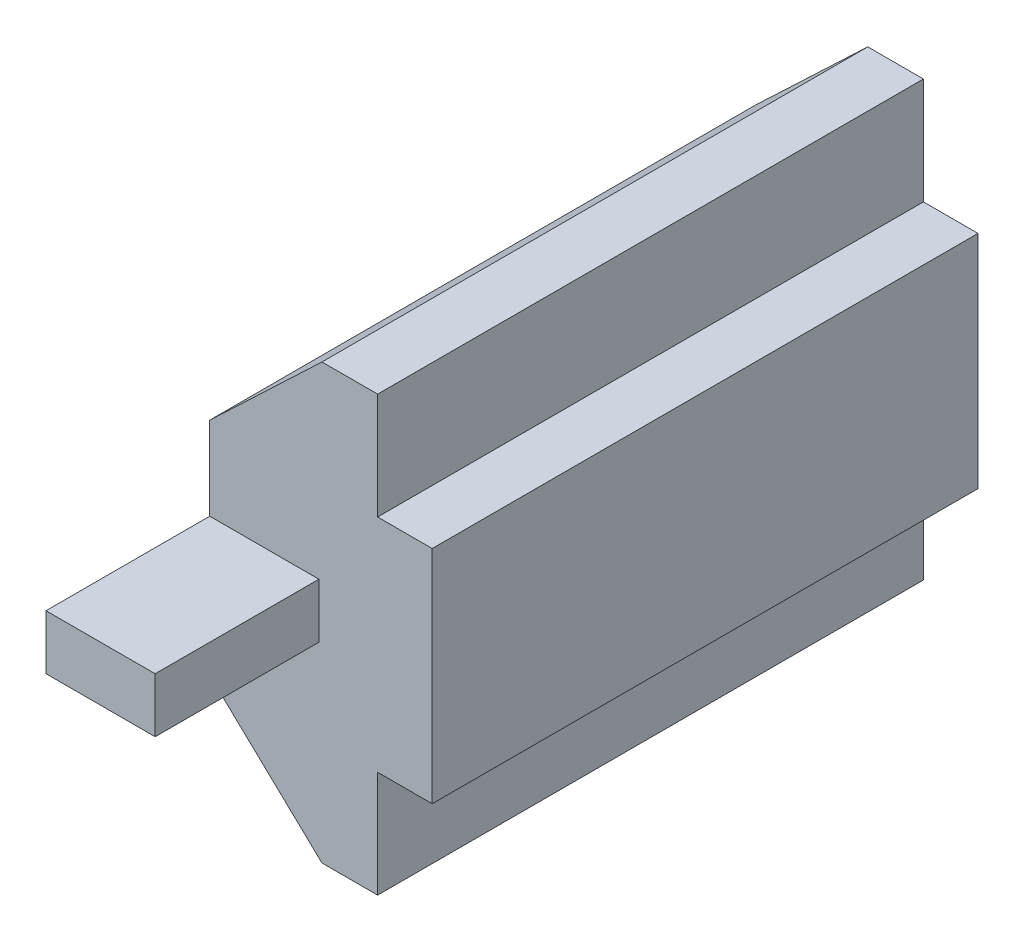
ISO-10303-21;
HEADER;
FILE_DESCRIPTION(('STEP AP214'),'2;1');
FILE_NAME('part.step','',(''),(''),'','','');
FILE_SCHEMA(('AUTOMOTIVE_DESIGN { 1 0 10303 214 1 1 1 1 }'));
ENDSEC;
DATA;
#1=APPLICATION_CONTEXT('core data for automotive mechanical design processes');
#2=APPLICATION_PROTOCOL_DEFINITION('international standard','automotive_design',2000,#1);
#3=PRODUCT_CONTEXT('',#1,'mechanical');
#4=PRODUCT('Part','Part','',(#3));
#5=PRODUCT_RELATED_PRODUCT_CATEGORY('part','',(#4));
#6=PRODUCT_DEFINITION_FORMATION('','',#4);
#7=PRODUCT_DEFINITION_CONTEXT('part definition',#1,'design');
#8=PRODUCT_DEFINITION('design','',#6,#7);
#9=PRODUCT_DEFINITION_SHAPE('','',#8);
#10=(LENGTH_UNIT() NAMED_UNIT(*) SI_UNIT(.MILLI.,.METRE.));
#11=(NAMED_UNIT(*) PLANE_ANGLE_UNIT() SI_UNIT($,.RADIAN.));
#12=(NAMED_UNIT(*) SI_UNIT($,.STERADIAN.) SOLID_ANGLE_UNIT());
#13=UNCERTAINTY_MEASURE_WITH_UNIT(LENGTH_MEASURE(1.E-05),#10,'distance_accuracy_value','');
#14=(GEOMETRIC_REPRESENTATION_CONTEXT(3) GLOBAL_UNCERTAINTY_ASSIGNED_CONTEXT((#13)) GLOBAL_UNIT_ASSIGNED_CONTEXT((#10,
#11,#12)) REPRESENTATION_CONTEXT('',''));
#15=CARTESIAN_POINT('',(0.,0.,0.));
#16=DIRECTION('',(0.,0.,1.));
#17=DIRECTION('',(1.,0.,0.));
#18=AXIS2_PLACEMENT_3D('',#15,#16,#17);
#19=CARTESIAN_POINT('',(0.,7.95,20.));
#20=DIRECTION('',(0.,1.,0.));
#21=DIRECTION('',(-1.,0.,0.));
#22=AXIS2_PLACEMENT_3D('',#19,#20,#21);
#23=PLANE('',#22);
#24=DIRECTION('',(1.,0.,0.));
#25=VECTOR('',#24,1.);
#26=CARTESIAN_POINT('',(0.,7.95,0.));
#27=LINE('',#26,#25);
#28=CARTESIAN_POINT('',(-2.04000000000008,7.94999999999998,0.));
#29=VERTEX_POINT('',#28);
#30=CARTESIAN_POINT('',(0.,7.95,0.));
#31=VERTEX_POINT('',#30);
#32=EDGE_CURVE('E170',#29,#31,#27,.T.);
#33=ORIENTED_EDGE('',*,*,#32,.F.);
#34=DIRECTION('',(0.,0.,-1.));
#35=VECTOR('',#34,1.);
#36=CARTESIAN_POINT('',(-2.04000000000008,7.94999999999998,20.));
#37=LINE('',#36,#35);
#38=CARTESIAN_POINT('',(-2.04000000000008,7.94999999999998,20.));
#39=VERTEX_POINT('',#38);
#40=EDGE_CURVE('E11',#39,#29,#37,.T.);
#41=ORIENTED_EDGE('',*,*,#40,.F.);
#42=DIRECTION('',(1.,0.,0.));
#43=VECTOR('',#42,1.);
#44=CARTESIAN_POINT('',(0.,7.95,20.));
#45=LINE('',#44,#43);
#46=CARTESIAN_POINT('',(0.,7.95,20.));
#47=VERTEX_POINT('',#46);
#48=EDGE_CURVE('E181',#39,#47,#45,.T.);
#49=ORIENTED_EDGE('',*,*,#48,.T.);
#50=DIRECTION('',(0.,0.,-1.));
#51=VECTOR('',#50,1.);
#52=CARTESIAN_POINT('',(0.,7.95,20.));
#53=LINE('',#52,#51);
#54=EDGE_CURVE('E250',#47,#31,#53,.T.);
#55=ORIENTED_EDGE('',*,*,#54,.T.);
#56=EDGE_LOOP('',(#33,#41,#49,#55));
#57=FACE_BOUND('',#56,.T.);
#58=ADVANCED_FACE('F45',(#57),#23,.T.);
#59=CARTESIAN_POINT('',(-4.93600140143802,5.20217481392659,20.));
#60=DIRECTION('',(-0.688304815664146,0.725421588273706,0.));
#61=DIRECTION('',(-0.725421588273706,-0.688304815664146,0.));
#62=AXIS2_PLACEMENT_3D('',#59,#60,#61);
#63=PLANE('',#62);
#64=DIRECTION('',(0.725421588273706,0.688304815664146,0.));
#65=VECTOR('',#64,1.);
#66=CARTESIAN_POINT('',(-4.93600140143802,5.20217481392659,0.));
#67=LINE('',#66,#65);
#68=CARTESIAN_POINT('',(-6.15241498392372,4.04799999999993,0.));
#69=VERTEX_POINT('',#68);
#70=EDGE_CURVE('E175',#69,#29,#67,.T.);
#71=ORIENTED_EDGE('',*,*,#70,.F.);
#72=DIRECTION('',(0.,0.,-1.));
#73=VECTOR('',#72,1.);
#74=CARTESIAN_POINT('',(-6.15241498392372,4.04799999999993,20.));
#75=LINE('',#74,#73);
#76=CARTESIAN_POINT('',(-6.15241498392372,4.04799999999993,20.));
#77=VERTEX_POINT('',#76);
#78=EDGE_CURVE('E53',#77,#69,#75,.T.);
#79=ORIENTED_EDGE('',*,*,#78,.F.);
#80=DIRECTION('',(0.725421588273706,0.688304815664146,0.));
#81=VECTOR('',#80,1.);
#82=CARTESIAN_POINT('',(-4.93600140143802,5.20217481392659,20.));
#83=LINE('',#82,#81);
#84=EDGE_CURVE('E185',#77,#39,#83,.T.);
#85=ORIENTED_EDGE('',*,*,#84,.T.);
#86=ORIENTED_EDGE('',*,*,#40,.T.);
#87=EDGE_LOOP('',(#71,#79,#85,#86));
#88=FACE_BOUND('',#87,.T.);
#89=ADVANCED_FACE('F281',(#88),#63,.T.);
#90=CARTESIAN_POINT('',(-6.15241498392368,0.,20.));
#91=DIRECTION('',(-1.,0.,0.));
#92=DIRECTION('',(0.,-1.,0.));
#93=AXIS2_PLACEMENT_3D('',#90,#91,#92);
#94=PLANE('',#93);
#95=DIRECTION('',(0.,1.,0.));
#96=VECTOR('',#95,1.);
#97=CARTESIAN_POINT('',(-6.15241498392368,0.,0.));
#98=LINE('',#97,#96);
#99=CARTESIAN_POINT('',(-6.15241498392364,-4.04800000000007,0.));
#100=VERTEX_POINT('',#99);
#101=EDGE_CURVE('E222',#100,#69,#98,.T.);
#102=ORIENTED_EDGE('',*,*,#101,.F.);
#103=DIRECTION('',(0.,0.,-1.));
#104=VECTOR('',#103,1.);
#105=CARTESIAN_POINT('',(-6.15241498392364,-4.04800000000007,20.));
#106=LINE('',#105,#104);
#107=CARTESIAN_POINT('',(-6.15241498392364,-4.04800000000007,20.));
#108=VERTEX_POINT('',#107);
#109=EDGE_CURVE('E271',#108,#100,#106,.T.);
#110=ORIENTED_EDGE('',*,*,#109,.F.);
#111=DIRECTION('',(0.,1.,0.));
#112=VECTOR('',#111,1.);
#113=CARTESIAN_POINT('',(-6.15241498392368,0.,20.));
#114=LINE('',#113,#112);
#115=CARTESIAN_POINT('',(-6.15241498392367,-1.,20.));
#116=VERTEX_POINT('',#115);
#117=EDGE_CURVE('E190',#108,#116,#114,.T.);
#118=ORIENTED_EDGE('',*,*,#117,.T.);
#119=DIRECTION('',(0.,0.,-1.));
#120=VECTOR('',#119,1.);
#121=CARTESIAN_POINT('',(-6.15241498392364,-1.,26.));
#122=LINE('',#121,#120);
#123=CARTESIAN_POINT('',(-6.15241498392364,-1.,26.));
#124=VERTEX_POINT('',#123);
#125=EDGE_CURVE('E302',#124,#116,#122,.T.);
#126=ORIENTED_EDGE('',*,*,#125,.F.);
#127=DIRECTION('',(0.,-1.,0.));
#128=VECTOR('',#127,1.);
#129=CARTESIAN_POINT('',(-6.15241498392358,1.,26.));
#130=LINE('',#129,#128);
#131=CARTESIAN_POINT('',(-6.15241498392358,1.,26.));
#132=VERTEX_POINT('',#131);
#133=EDGE_CURVE('E160',#132,#124,#130,.T.);
#134=ORIENTED_EDGE('',*,*,#133,.F.);
#135=DIRECTION('',(0.,0.,-1.));
#136=VECTOR('',#135,1.);
#137=CARTESIAN_POINT('',(-6.15241498392358,1.,26.));
#138=LINE('',#137,#136);
#139=CARTESIAN_POINT('',(-6.15241498392369,1.,20.));
#140=VERTEX_POINT('',#139);
#141=EDGE_CURVE('E177',#132,#140,#138,.T.);
#142=ORIENTED_EDGE('',*,*,#141,.T.);
#143=EDGE_CURVE('E66',#140,#77,#114,.T.);
#144=ORIENTED_EDGE('',*,*,#143,.T.);
#145=ORIENTED_EDGE('',*,*,#78,.T.);
#146=EDGE_LOOP('',(#102,#110,#118,#126,#134,#142,#144,#145));
#147=FACE_BOUND('',#146,.T.);
#148=ADVANCED_FACE('F278',(#147),#94,.T.);
#149=CARTESIAN_POINT('',(-4.93600140143791,-5.2021748139267,20.));
#150=DIRECTION('',(-0.68830481566413,-0.725421588273721,0.));
#151=DIRECTION('',(0.725421588273721,-0.68830481566413,0.));
#152=AXIS2_PLACEMENT_3D('',#149,#150,#151);
#153=PLANE('',#152);
#154=DIRECTION('',(-0.725421588273721,0.68830481566413,0.));
#155=VECTOR('',#154,1.);
#156=CARTESIAN_POINT('',(-4.93600140143791,-5.2021748139267,0.));
#157=LINE('',#156,#155);
#158=CARTESIAN_POINT('',(-2.03999999999991,-7.95000000000002,0.));
#159=VERTEX_POINT('',#158);
#160=EDGE_CURVE('E226',#159,#100,#157,.T.);
#161=ORIENTED_EDGE('',*,*,#160,.F.);
#162=DIRECTION('',(0.,0.,-1.));
#163=VECTOR('',#162,1.);
#164=CARTESIAN_POINT('',(-2.03999999999991,-7.95000000000002,20.));
#165=LINE('',#164,#163);
#166=CARTESIAN_POINT('',(-2.03999999999991,-7.95000000000002,20.));
#167=VERTEX_POINT('',#166);
#168=EDGE_CURVE('E268',#167,#159,#165,.T.);
#169=ORIENTED_EDGE('',*,*,#168,.F.);
#170=DIRECTION('',(-0.725421588273721,0.68830481566413,0.));
#171=VECTOR('',#170,1.);
#172=CARTESIAN_POINT('',(-4.93600140143791,-5.2021748139267,20.));
#173=LINE('',#172,#171);
#174=EDGE_CURVE('E194',#167,#108,#173,.T.);
#175=ORIENTED_EDGE('',*,*,#174,.T.);
#176=ORIENTED_EDGE('',*,*,#109,.T.);
#177=EDGE_LOOP('',(#161,#169,#175,#176));
#178=FACE_BOUND('',#177,.T.);
#179=ADVANCED_FACE('F288',(#178),#153,.T.);
#180=CARTESIAN_POINT('',(0.,-7.95,20.));
#181=DIRECTION('',(0.,-1.,0.));
#182=DIRECTION('',(1.,0.,0.));
#183=AXIS2_PLACEMENT_3D('',#180,#181,#182);
#184=PLANE('',#183);
#185=DIRECTION('',(-1.,0.,0.));
#186=VECTOR('',#185,1.);
#187=CARTESIAN_POINT('',(0.,-7.95,0.));
#188=LINE('',#187,#186);
#189=CARTESIAN_POINT('',(0.,-7.95,0.));
#190=VERTEX_POINT('',#189);
#191=EDGE_CURVE('E230',#190,#159,#188,.T.);
#192=ORIENTED_EDGE('',*,*,#191,.F.);
#193=DIRECTION('',(0.,0.,-1.));
#194=VECTOR('',#193,1.);
#195=CARTESIAN_POINT('',(0.,-7.95,20.));
#196=LINE('',#195,#194);
#197=CARTESIAN_POINT('',(0.,-7.95,20.));
#198=VERTEX_POINT('',#197);
#199=EDGE_CURVE('E265',#198,#190,#196,.T.);
#200=ORIENTED_EDGE('',*,*,#199,.F.);
#201=DIRECTION('',(-1.,0.,0.));
#202=VECTOR('',#201,1.);
#203=CARTESIAN_POINT('',(0.,-7.95,20.));
#204=LINE('',#203,#202);
#205=EDGE_CURVE('E198',#198,#167,#204,.T.);
#206=ORIENTED_EDGE('',*,*,#205,.T.);
#207=ORIENTED_EDGE('',*,*,#168,.T.);
#208=EDGE_LOOP('',(#192,#200,#206,#207));
#209=FACE_BOUND('',#208,.T.);
#210=ADVANCED_FACE('F350',(#209),#184,.T.);
#211=CARTESIAN_POINT('',(0.,0.,20.));
#212=DIRECTION('',(1.,0.,0.));
#213=DIRECTION('',(0.,1.,0.));
#214=AXIS2_PLACEMENT_3D('',#211,#212,#213);
#215=PLANE('',#214);
#216=DIRECTION('',(0.,-1.,0.));
#217=VECTOR('',#216,1.);
#218=CARTESIAN_POINT('',(0.,0.,0.));
#219=LINE('',#218,#217);
#220=CARTESIAN_POINT('',(0.,-4.05,0.));
#221=VERTEX_POINT('',#220);
#222=EDGE_CURVE('E234',#221,#190,#219,.T.);
#223=ORIENTED_EDGE('',*,*,#222,.F.);
#224=DIRECTION('',(0.,0.,-1.));
#225=VECTOR('',#224,1.);
#226=CARTESIAN_POINT('',(0.,-4.05,20.));
#227=LINE('',#226,#225);
#228=CARTESIAN_POINT('',(0.,-4.05,20.));
#229=VERTEX_POINT('',#228);
#230=EDGE_CURVE('E262',#229,#221,#227,.T.);
#231=ORIENTED_EDGE('',*,*,#230,.F.);
#232=DIRECTION('',(0.,-1.,0.));
#233=VECTOR('',#232,1.);
#234=CARTESIAN_POINT('',(0.,0.,20.));
#235=LINE('',#234,#233);
#236=EDGE_CURVE('E202',#229,#198,#235,.T.);
#237=ORIENTED_EDGE('',*,*,#236,.T.);
#238=ORIENTED_EDGE('',*,*,#199,.T.);
#239=EDGE_LOOP('',(#223,#231,#237,#238));
#240=FACE_BOUND('',#239,.T.);
#241=ADVANCED_FACE('F348',(#240),#215,.T.);
#242=CARTESIAN_POINT('',(0.,-4.05,20.));
#243=DIRECTION('',(0.,-1.,0.));
#244=DIRECTION('',(0.,0.,-1.));
#245=AXIS2_PLACEMENT_3D('',#242,#243,#244);
#246=PLANE('',#245);
#247=DIRECTION('',(-1.,0.,0.));
#248=VECTOR('',#247,1.);
#249=CARTESIAN_POINT('',(0.,-4.05,0.));
#250=LINE('',#249,#248);
#251=CARTESIAN_POINT('',(1.99999999999992,-4.05,0.));
#252=VERTEX_POINT('',#251);
#253=EDGE_CURVE('E238',#252,#221,#250,.T.);
#254=ORIENTED_EDGE('',*,*,#253,.F.);
#255=DIRECTION('',(0.,0.,-1.));
#256=VECTOR('',#255,1.);
#257=CARTESIAN_POINT('',(1.99999999999992,-4.05,20.));
#258=LINE('',#257,#256);
#259=CARTESIAN_POINT('',(1.99999999999992,-4.05,20.));
#260=VERTEX_POINT('',#259);
#261=EDGE_CURVE('E259',#260,#252,#258,.T.);
#262=ORIENTED_EDGE('',*,*,#261,.F.);
#263=DIRECTION('',(-1.,0.,0.));
#264=VECTOR('',#263,1.);
#265=CARTESIAN_POINT('',(0.,-4.05,20.));
#266=LINE('',#265,#264);
#267=EDGE_CURVE('E206',#260,#229,#266,.T.);
#268=ORIENTED_EDGE('',*,*,#267,.T.);
#269=ORIENTED_EDGE('',*,*,#230,.T.);
#270=EDGE_LOOP('',(#254,#262,#268,#269));
#271=FACE_BOUND('',#270,.T.);
#272=ADVANCED_FACE('F344',(#271),#246,.T.);
#273=CARTESIAN_POINT('',(1.99999999999992,0.,20.));
#274=DIRECTION('',(1.,0.,0.));
#275=DIRECTION('',(0.,1.,0.));
#276=AXIS2_PLACEMENT_3D('',#273,#274,#275);
#277=PLANE('',#276);
#278=DIRECTION('',(0.,-1.,0.));
#279=VECTOR('',#278,1.);
#280=CARTESIAN_POINT('',(1.99999999999992,0.,0.));
#281=LINE('',#280,#279);
#282=CARTESIAN_POINT('',(1.99999999999992,4.05,0.));
#283=VERTEX_POINT('',#282);
#284=EDGE_CURVE('E242',#283,#252,#281,.T.);
#285=ORIENTED_EDGE('',*,*,#284,.F.);
#286=DIRECTION('',(0.,0.,-1.));
#287=VECTOR('',#286,1.);
#288=CARTESIAN_POINT('',(1.99999999999992,4.05,20.));
#289=LINE('',#288,#287);
#290=CARTESIAN_POINT('',(1.99999999999992,4.05,20.));
#291=VERTEX_POINT('',#290);
#292=EDGE_CURVE('E256',#291,#283,#289,.T.);
#293=ORIENTED_EDGE('',*,*,#292,.F.);
#294=DIRECTION('',(0.,-1.,0.));
#295=VECTOR('',#294,1.);
#296=CARTESIAN_POINT('',(1.99999999999992,0.,20.));
#297=LINE('',#296,#295);
#298=EDGE_CURVE('E211',#291,#260,#297,.T.);
#299=ORIENTED_EDGE('',*,*,#298,.T.);
#300=ORIENTED_EDGE('',*,*,#261,.T.);
#301=EDGE_LOOP('',(#285,#293,#299,#300));
#302=FACE_BOUND('',#301,.T.);
#303=ADVANCED_FACE('F342',(#302),#277,.T.);
#304=CARTESIAN_POINT('',(0.,4.05,20.));
#305=DIRECTION('',(0.,1.,0.));
#306=DIRECTION('',(0.,0.,1.));
#307=AXIS2_PLACEMENT_3D('',#304,#305,#306);
#308=PLANE('',#307);
#309=DIRECTION('',(1.,0.,0.));
#310=VECTOR('',#309,1.);
#311=CARTESIAN_POINT('',(0.,4.05,0.));
#312=LINE('',#311,#310);
#313=CARTESIAN_POINT('',(0.,4.05,0.));
#314=VERTEX_POINT('',#313);
#315=EDGE_CURVE('E246',#314,#283,#312,.T.);
#316=ORIENTED_EDGE('',*,*,#315,.F.);
#317=DIRECTION('',(0.,0.,-1.));
#318=VECTOR('',#317,1.);
#319=CARTESIAN_POINT('',(0.,4.05,20.));
#320=LINE('',#319,#318);
#321=CARTESIAN_POINT('',(0.,4.05,20.));
#322=VERTEX_POINT('',#321);
#323=EDGE_CURVE('E253',#322,#314,#320,.T.);
#324=ORIENTED_EDGE('',*,*,#323,.F.);
#325=DIRECTION('',(1.,0.,0.));
#326=VECTOR('',#325,1.);
#327=CARTESIAN_POINT('',(0.,4.05,20.));
#328=LINE('',#327,#326);
#329=EDGE_CURVE('E215',#322,#291,#328,.T.);
#330=ORIENTED_EDGE('',*,*,#329,.T.);
#331=ORIENTED_EDGE('',*,*,#292,.T.);
#332=EDGE_LOOP('',(#316,#324,#330,#331));
#333=FACE_BOUND('',#332,.T.);
#334=ADVANCED_FACE('F338',(#333),#308,.T.);
#335=EDGE_CURVE('E186',#31,#314,#219,.T.);
#336=ORIENTED_EDGE('',*,*,#335,.F.);
#337=ORIENTED_EDGE('',*,*,#54,.F.);
#338=EDGE_CURVE('E207',#47,#322,#235,.T.);
#339=ORIENTED_EDGE('',*,*,#338,.T.);
#340=ORIENTED_EDGE('',*,*,#323,.T.);
#341=EDGE_LOOP('',(#336,#337,#339,#340));
#342=FACE_BOUND('',#341,.T.);
#343=ADVANCED_FACE('F327',(#342),#215,.T.);
#344=CARTESIAN_POINT('',(0.,0.,20.));
#345=DIRECTION('',(0.,0.,1.));
#346=DIRECTION('',(1.,0.,0.));
#347=AXIS2_PLACEMENT_3D('',#344,#345,#346);
#348=PLANE('',#347);
#349=DIRECTION('',(1.,0.,0.));
#350=VECTOR('',#349,1.);
#351=CARTESIAN_POINT('',(-6.15241498392364,-1.,20.));
#352=LINE('',#351,#350);
#353=CARTESIAN_POINT('',(-2.15241498392358,-1.,20.));
#354=VERTEX_POINT('',#353);
#355=EDGE_CURVE('E168',#116,#354,#352,.T.);
#356=ORIENTED_EDGE('',*,*,#355,.F.);
#357=ORIENTED_EDGE('',*,*,#117,.F.);
#358=ORIENTED_EDGE('',*,*,#174,.F.);
#359=ORIENTED_EDGE('',*,*,#205,.F.);
#360=ORIENTED_EDGE('',*,*,#236,.F.);
#361=ORIENTED_EDGE('',*,*,#267,.F.);
#362=ORIENTED_EDGE('',*,*,#298,.F.);
#363=ORIENTED_EDGE('',*,*,#329,.F.);
#364=ORIENTED_EDGE('',*,*,#338,.F.);
#365=ORIENTED_EDGE('',*,*,#48,.F.);
#366=ORIENTED_EDGE('',*,*,#84,.F.);
#367=ORIENTED_EDGE('',*,*,#143,.F.);
#368=DIRECTION('',(-1.,0.,0.));
#369=VECTOR('',#368,1.);
#370=CARTESIAN_POINT('',(-2.15241498392358,1.,20.));
#371=LINE('',#370,#369);
#372=CARTESIAN_POINT('',(-2.15241498392358,1.,20.));
#373=VERTEX_POINT('',#372);
#374=EDGE_CURVE('E165',#373,#140,#371,.T.);
#375=ORIENTED_EDGE('',*,*,#374,.F.);
#376=DIRECTION('',(0.,1.,0.));
#377=VECTOR('',#376,1.);
#378=CARTESIAN_POINT('',(-2.15241498392358,-1.,20.));
#379=LINE('',#378,#377);
#380=EDGE_CURVE('E60',#354,#373,#379,.T.);
#381=ORIENTED_EDGE('',*,*,#380,.F.);
#382=EDGE_LOOP('',(#356,#357,#358,#359,#360,#361,#362,#363,#364,#365,#366,#367,#375,#381));
#383=FACE_BOUND('',#382,.T.);
#384=ADVANCED_FACE('F291',(#383),#348,.T.);
#385=CARTESIAN_POINT('',(0.,0.,0.));
#386=DIRECTION('',(0.,0.,1.));
#387=DIRECTION('',(1.,0.,0.));
#388=AXIS2_PLACEMENT_3D('',#385,#386,#387);
#389=PLANE('',#388);
#390=ORIENTED_EDGE('',*,*,#32,.T.);
#391=ORIENTED_EDGE('',*,*,#335,.T.);
#392=ORIENTED_EDGE('',*,*,#315,.T.);
#393=ORIENTED_EDGE('',*,*,#284,.T.);
#394=ORIENTED_EDGE('',*,*,#253,.T.);
#395=ORIENTED_EDGE('',*,*,#222,.T.);
#396=ORIENTED_EDGE('',*,*,#191,.T.);
#397=ORIENTED_EDGE('',*,*,#160,.T.);
#398=ORIENTED_EDGE('',*,*,#101,.T.);
#399=ORIENTED_EDGE('',*,*,#70,.T.);
#400=EDGE_LOOP('',(#390,#391,#392,#393,#394,#395,#396,#397,#398,#399));
#401=FACE_BOUND('',#400,.T.);
#402=ADVANCED_FACE('F284',(#401),#389,.F.);
#403=CARTESIAN_POINT('',(-6.15241498392364,-1.,26.));
#404=DIRECTION('',(0.,1.,0.));
#405=DIRECTION('',(0.,0.,1.));
#406=AXIS2_PLACEMENT_3D('',#403,#404,#405);
#407=PLANE('',#406);
#408=ORIENTED_EDGE('',*,*,#355,.T.);
#409=DIRECTION('',(0.,0.,-1.));
#410=VECTOR('',#409,1.);
#411=CARTESIAN_POINT('',(-2.15241498392358,-1.,26.));
#412=LINE('',#411,#410);
#413=CARTESIAN_POINT('',(-2.15241498392358,-1.,26.));
#414=VERTEX_POINT('',#413);
#415=EDGE_CURVE('E147',#414,#354,#412,.T.);
#416=ORIENTED_EDGE('',*,*,#415,.F.);
#417=DIRECTION('',(1.,0.,0.));
#418=VECTOR('',#417,1.);
#419=CARTESIAN_POINT('',(-6.15241498392364,-1.,26.));
#420=LINE('',#419,#418);
#421=EDGE_CURVE('E155',#124,#414,#420,.T.);
#422=ORIENTED_EDGE('',*,*,#421,.F.);
#423=ORIENTED_EDGE('',*,*,#125,.T.);
#424=EDGE_LOOP('',(#408,#416,#422,#423));
#425=FACE_BOUND('',#424,.T.);
#426=ADVANCED_FACE('F167',(#425),#407,.F.);
#427=CARTESIAN_POINT('',(-2.15241498392358,-1.,26.));
#428=DIRECTION('',(-1.,0.,0.));
#429=DIRECTION('',(0.,0.,1.));
#430=AXIS2_PLACEMENT_3D('',#427,#428,#429);
#431=PLANE('',#430);
#432=ORIENTED_EDGE('',*,*,#380,.T.);
#433=DIRECTION('',(0.,0.,-1.));
#434=VECTOR('',#433,1.);
#435=CARTESIAN_POINT('',(-2.15241498392358,1.,26.));
#436=LINE('',#435,#434);
#437=CARTESIAN_POINT('',(-2.15241498392358,1.,26.));
#438=VERTEX_POINT('',#437);
#439=EDGE_CURVE('E150',#438,#373,#436,.T.);
#440=ORIENTED_EDGE('',*,*,#439,.F.);
#441=DIRECTION('',(0.,1.,0.));
#442=VECTOR('',#441,1.);
#443=CARTESIAN_POINT('',(-2.15241498392358,-1.,26.));
#444=LINE('',#443,#442);
#445=EDGE_CURVE('E143',#414,#438,#444,.T.);
#446=ORIENTED_EDGE('',*,*,#445,.F.);
#447=ORIENTED_EDGE('',*,*,#415,.T.);
#448=EDGE_LOOP('',(#432,#440,#446,#447));
#449=FACE_BOUND('',#448,.T.);
#450=ADVANCED_FACE('F145',(#449),#431,.F.);
#451=CARTESIAN_POINT('',(-2.15241498392358,1.,26.));
#452=DIRECTION('',(0.,-1.,0.));
#453=DIRECTION('',(1.,0.,0.));
#454=AXIS2_PLACEMENT_3D('',#451,#452,#453);
#455=PLANE('',#454);
#456=ORIENTED_EDGE('',*,*,#374,.T.);
#457=ORIENTED_EDGE('',*,*,#141,.F.);
#458=DIRECTION('',(-1.,0.,0.));
#459=VECTOR('',#458,1.);
#460=CARTESIAN_POINT('',(-2.15241498392358,1.,26.));
#461=LINE('',#460,#459);
#462=EDGE_CURVE('E154',#438,#132,#461,.T.);
#463=ORIENTED_EDGE('',*,*,#462,.F.);
#464=ORIENTED_EDGE('',*,*,#439,.T.);
#465=EDGE_LOOP('',(#456,#457,#463,#464));
#466=FACE_BOUND('',#465,.T.);
#467=ADVANCED_FACE('F307',(#466),#455,.F.);
#468=CARTESIAN_POINT('',(0.,0.,26.));
#469=DIRECTION('',(0.,0.,1.));
#470=DIRECTION('',(1.,0.,0.));
#471=AXIS2_PLACEMENT_3D('',#468,#469,#470);
#472=PLANE('',#471);
#473=ORIENTED_EDGE('',*,*,#421,.T.);
#474=ORIENTED_EDGE('',*,*,#445,.T.);
#475=ORIENTED_EDGE('',*,*,#462,.T.);
#476=ORIENTED_EDGE('',*,*,#133,.T.);
#477=EDGE_LOOP('',(#473,#474,#475,#476));
#478=FACE_BOUND('',#477,.T.);
#479=ADVANCED_FACE('F158',(#478),#472,.T.);
#480=CLOSED_SHELL('',(#58,#89,#148,#179,#210,#241,#272,#303,#334,#343,#384,#402,#426,#450,#467,#479));
#481=MANIFOLD_SOLID_BREP('B2',#480);
#482=ADVANCED_BREP_SHAPE_REPRESENTATION('',(#18,#481),#14);
#483=SHAPE_DEFINITION_REPRESENTATION(#9,#482);
ENDSEC;
END-ISO-10303-21;
